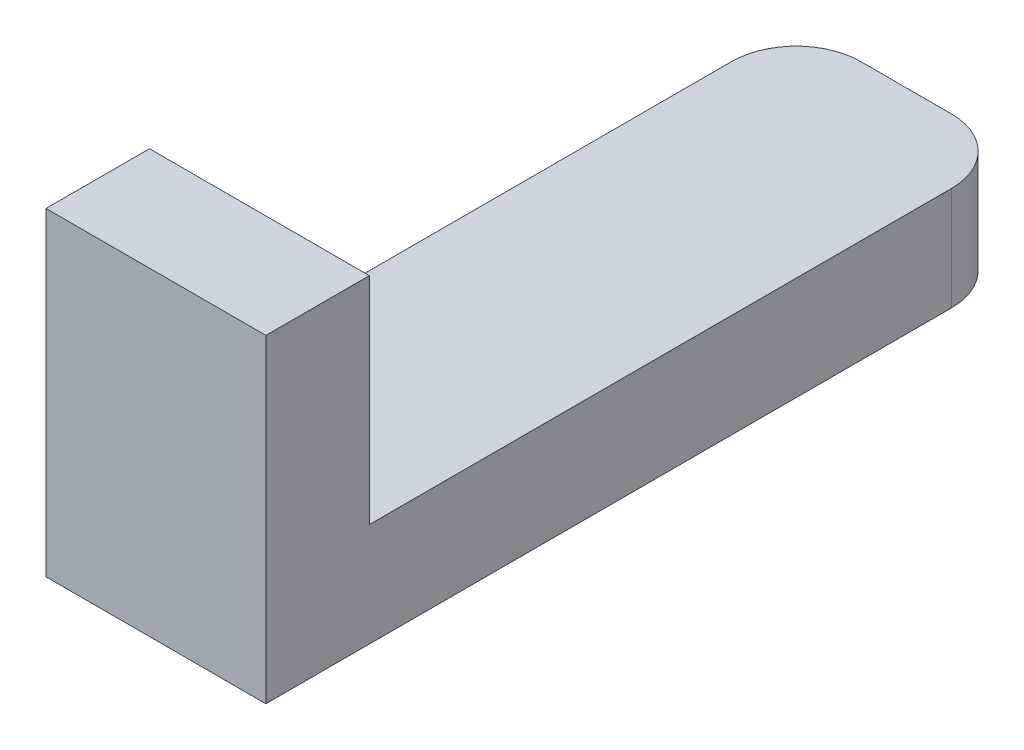
ISO-10303-21;
HEADER;
FILE_DESCRIPTION(('STEP AP214'),'2;1');
FILE_NAME('part.step','',(''),(''),'','','');
FILE_SCHEMA(('AUTOMOTIVE_DESIGN { 1 0 10303 214 1 1 1 1 }'));
ENDSEC;
DATA;
#1=APPLICATION_CONTEXT('core data for automotive mechanical design processes');
#2=APPLICATION_PROTOCOL_DEFINITION('international standard','automotive_design',2000,#1);
#3=PRODUCT_CONTEXT('',#1,'mechanical');
#4=PRODUCT('Part','Part','',(#3));
#5=PRODUCT_RELATED_PRODUCT_CATEGORY('part','',(#4));
#6=PRODUCT_DEFINITION_FORMATION('','',#4);
#7=PRODUCT_DEFINITION_CONTEXT('part definition',#1,'design');
#8=PRODUCT_DEFINITION('design','',#6,#7);
#9=PRODUCT_DEFINITION_SHAPE('','',#8);
#10=(LENGTH_UNIT() NAMED_UNIT(*) SI_UNIT(.MILLI.,.METRE.));
#11=(NAMED_UNIT(*) PLANE_ANGLE_UNIT() SI_UNIT($,.RADIAN.));
#12=(NAMED_UNIT(*) SI_UNIT($,.STERADIAN.) SOLID_ANGLE_UNIT());
#13=UNCERTAINTY_MEASURE_WITH_UNIT(LENGTH_MEASURE(1.E-05),#10,'distance_accuracy_value','');
#14=(GEOMETRIC_REPRESENTATION_CONTEXT(3) GLOBAL_UNCERTAINTY_ASSIGNED_CONTEXT((#13)) GLOBAL_UNIT_ASSIGNED_CONTEXT((#10,
#11,#12)) REPRESENTATION_CONTEXT('',''));
#15=CARTESIAN_POINT('',(0.,0.,0.));
#16=DIRECTION('',(0.,0.,1.));
#17=DIRECTION('',(1.,0.,0.));
#18=AXIS2_PLACEMENT_3D('',#15,#16,#17);
#19=CARTESIAN_POINT('',(6.477,9.398,22.098));
#20=DIRECTION('',(0.,0.,-1.));
#21=DIRECTION('',(-1.,0.,0.));
#22=AXIS2_PLACEMENT_3D('',#19,#20,#21);
#23=PLANE('',#22);
#24=DIRECTION('',(0.,-1.,0.));
#25=VECTOR('',#24,1.);
#26=CARTESIAN_POINT('',(0.,9.398,22.098));
#27=LINE('',#26,#25);
#28=CARTESIAN_POINT('',(0.,9.398,22.098));
#29=VERTEX_POINT('',#28);
#30=CARTESIAN_POINT('',(0.,0.,22.098));
#31=VERTEX_POINT('',#30);
#32=EDGE_CURVE('E128',#29,#31,#27,.T.);
#33=ORIENTED_EDGE('',*,*,#32,.T.);
#34=DIRECTION('',(-1.,0.,0.));
#35=VECTOR('',#34,1.);
#36=CARTESIAN_POINT('',(6.477,0.,22.098));
#37=LINE('',#36,#35);
#38=CARTESIAN_POINT('',(6.477,0.,22.098));
#39=VERTEX_POINT('',#38);
#40=EDGE_CURVE('E109',#39,#31,#37,.T.);
#41=ORIENTED_EDGE('',*,*,#40,.F.);
#42=DIRECTION('',(0.,-1.,0.));
#43=VECTOR('',#42,1.);
#44=CARTESIAN_POINT('',(6.477,9.398,22.098));
#45=LINE('',#44,#43);
#46=CARTESIAN_POINT('',(6.477,9.398,22.098));
#47=VERTEX_POINT('',#46);
#48=EDGE_CURVE('E115',#47,#39,#45,.T.);
#49=ORIENTED_EDGE('',*,*,#48,.F.);
#50=DIRECTION('',(-1.,0.,0.));
#51=VECTOR('',#50,1.);
#52=CARTESIAN_POINT('',(6.477,9.398,22.098));
#53=LINE('',#52,#51);
#54=EDGE_CURVE('E184',#47,#29,#53,.T.);
#55=ORIENTED_EDGE('',*,*,#54,.T.);
#56=EDGE_LOOP('',(#33,#41,#49,#55));
#57=FACE_BOUND('',#56,.T.);
#58=ADVANCED_FACE('F39',(#57),#23,.F.);
#59=CARTESIAN_POINT('',(6.477,0.,22.098));
#60=DIRECTION('',(0.,1.,0.));
#61=DIRECTION('',(0.,0.,1.));
#62=AXIS2_PLACEMENT_3D('',#59,#60,#61);
#63=PLANE('',#62);
#64=DIRECTION('',(0.,0.,-1.));
#65=VECTOR('',#64,1.);
#66=CARTESIAN_POINT('',(0.,0.,22.098));
#67=LINE('',#66,#65);
#68=CARTESIAN_POINT('',(0.,0.,1.905));
#69=VERTEX_POINT('',#68);
#70=EDGE_CURVE('E156',#31,#69,#67,.T.);
#71=ORIENTED_EDGE('',*,*,#70,.T.);
#72=CARTESIAN_POINT('',(1.905,0.,1.905));
#73=DIRECTION('',(0.,1.,0.));
#74=DIRECTION('',(0.,0.,1.));
#75=AXIS2_PLACEMENT_3D('',#72,#73,#74);
#76=CIRCLE('',#75,1.905);
#77=CARTESIAN_POINT('',(1.905,0.,0.));
#78=VERTEX_POINT('',#77);
#79=EDGE_CURVE('E48',#69,#78,#76,.F.);
#80=ORIENTED_EDGE('',*,*,#79,.T.);
#81=DIRECTION('',(-1.,0.,0.));
#82=VECTOR('',#81,1.);
#83=CARTESIAN_POINT('',(6.477,0.,0.));
#84=LINE('',#83,#82);
#85=CARTESIAN_POINT('',(4.572,0.,0.));
#86=VERTEX_POINT('',#85);
#87=EDGE_CURVE('E131',#86,#78,#84,.T.);
#88=ORIENTED_EDGE('',*,*,#87,.F.);
#89=CARTESIAN_POINT('',(4.572,0.,1.905));
#90=DIRECTION('',(0.,1.,0.));
#91=DIRECTION('',(0.,0.,1.));
#92=AXIS2_PLACEMENT_3D('',#89,#90,#91);
#93=CIRCLE('',#92,1.905);
#94=CARTESIAN_POINT('',(6.477,0.,1.905));
#95=VERTEX_POINT('',#94);
#96=EDGE_CURVE('E55',#86,#95,#93,.F.);
#97=ORIENTED_EDGE('',*,*,#96,.T.);
#98=DIRECTION('',(0.,0.,-1.));
#99=VECTOR('',#98,1.);
#100=CARTESIAN_POINT('',(6.477,0.,22.098));
#101=LINE('',#100,#99);
#102=EDGE_CURVE('E105',#39,#95,#101,.T.);
#103=ORIENTED_EDGE('',*,*,#102,.F.);
#104=ORIENTED_EDGE('',*,*,#40,.T.);
#105=EDGE_LOOP('',(#71,#80,#88,#97,#103,#104));
#106=FACE_BOUND('',#105,.T.);
#107=ADVANCED_FACE('F107',(#106),#63,.F.);
#108=CARTESIAN_POINT('',(6.477,0.,0.));
#109=DIRECTION('',(0.,0.,1.));
#110=DIRECTION('',(1.,0.,0.));
#111=AXIS2_PLACEMENT_3D('',#108,#109,#110);
#112=PLANE('',#111);
#113=ORIENTED_EDGE('',*,*,#87,.T.);
#114=DIRECTION('',(0.,1.,0.));
#115=VECTOR('',#114,1.);
#116=CARTESIAN_POINT('',(1.905,0.,0.));
#117=LINE('',#116,#115);
#118=CARTESIAN_POINT('',(1.905,3.048,0.));
#119=VERTEX_POINT('',#118);
#120=EDGE_CURVE('E135',#78,#119,#117,.T.);
#121=ORIENTED_EDGE('',*,*,#120,.T.);
#122=DIRECTION('',(-1.,0.,0.));
#123=VECTOR('',#122,1.);
#124=CARTESIAN_POINT('',(6.477,3.048,0.));
#125=LINE('',#124,#123);
#126=CARTESIAN_POINT('',(4.572,3.048,0.));
#127=VERTEX_POINT('',#126);
#128=EDGE_CURVE('E138',#127,#119,#125,.T.);
#129=ORIENTED_EDGE('',*,*,#128,.F.);
#130=DIRECTION('',(0.,1.,0.));
#131=VECTOR('',#130,1.);
#132=CARTESIAN_POINT('',(4.572,0.,0.));
#133=LINE('',#132,#131);
#134=EDGE_CURVE('E130',#127,#86,#133,.F.);
#135=ORIENTED_EDGE('',*,*,#134,.T.);
#136=EDGE_LOOP('',(#113,#121,#129,#135));
#137=FACE_BOUND('',#136,.T.);
#138=ADVANCED_FACE('F160',(#137),#112,.F.);
#139=CARTESIAN_POINT('',(6.477,3.048,0.));
#140=DIRECTION('',(0.,-1.,0.));
#141=DIRECTION('',(0.,0.,-1.));
#142=AXIS2_PLACEMENT_3D('',#139,#140,#141);
#143=PLANE('',#142);
#144=ORIENTED_EDGE('',*,*,#128,.T.);
#145=CARTESIAN_POINT('',(1.905,3.048,1.905));
#146=DIRECTION('',(0.,-1.,0.));
#147=DIRECTION('',(0.,0.,-1.));
#148=AXIS2_PLACEMENT_3D('',#145,#146,#147);
#149=CIRCLE('',#148,1.905);
#150=CARTESIAN_POINT('',(0.,3.048,1.905));
#151=VERTEX_POINT('',#150);
#152=EDGE_CURVE('E148',#119,#151,#149,.F.);
#153=ORIENTED_EDGE('',*,*,#152,.T.);
#154=DIRECTION('',(0.,0.,1.));
#155=VECTOR('',#154,1.);
#156=CARTESIAN_POINT('',(0.,3.048,0.));
#157=LINE('',#156,#155);
#158=CARTESIAN_POINT('',(0.,3.048,19.05));
#159=VERTEX_POINT('',#158);
#160=EDGE_CURVE('E168',#151,#159,#157,.T.);
#161=ORIENTED_EDGE('',*,*,#160,.T.);
#162=DIRECTION('',(-1.,0.,0.));
#163=VECTOR('',#162,1.);
#164=CARTESIAN_POINT('',(6.477,3.048,19.05));
#165=LINE('',#164,#163);
#166=CARTESIAN_POINT('',(6.477,3.048,19.05));
#167=VERTEX_POINT('',#166);
#168=EDGE_CURVE('E191',#167,#159,#165,.T.);
#169=ORIENTED_EDGE('',*,*,#168,.F.);
#170=DIRECTION('',(0.,0.,1.));
#171=VECTOR('',#170,1.);
#172=CARTESIAN_POINT('',(6.477,3.048,0.));
#173=LINE('',#172,#171);
#174=CARTESIAN_POINT('',(6.477,3.048,1.905));
#175=VERTEX_POINT('',#174);
#176=EDGE_CURVE('E114',#175,#167,#173,.T.);
#177=ORIENTED_EDGE('',*,*,#176,.F.);
#178=CARTESIAN_POINT('',(4.572,3.048,1.905));
#179=DIRECTION('',(0.,-1.,0.));
#180=DIRECTION('',(0.,0.,-1.));
#181=AXIS2_PLACEMENT_3D('',#178,#179,#180);
#182=CIRCLE('',#181,1.905);
#183=EDGE_CURVE('E145',#175,#127,#182,.F.);
#184=ORIENTED_EDGE('',*,*,#183,.T.);
#185=EDGE_LOOP('',(#144,#153,#161,#169,#177,#184));
#186=FACE_BOUND('',#185,.T.);
#187=ADVANCED_FACE('F166',(#186),#143,.F.);
#188=CARTESIAN_POINT('',(6.477,3.048,19.05));
#189=DIRECTION('',(0.,0.,1.));
#190=DIRECTION('',(1.,0.,0.));
#191=AXIS2_PLACEMENT_3D('',#188,#189,#190);
#192=PLANE('',#191);
#193=DIRECTION('',(0.,1.,0.));
#194=VECTOR('',#193,1.);
#195=CARTESIAN_POINT('',(0.,3.048,19.05));
#196=LINE('',#195,#194);
#197=CARTESIAN_POINT('',(0.,9.398,19.05));
#198=VERTEX_POINT('',#197);
#199=EDGE_CURVE('E173',#159,#198,#196,.T.);
#200=ORIENTED_EDGE('',*,*,#199,.T.);
#201=DIRECTION('',(-1.,0.,0.));
#202=VECTOR('',#201,1.);
#203=CARTESIAN_POINT('',(6.477,9.398,19.05));
#204=LINE('',#203,#202);
#205=CARTESIAN_POINT('',(6.477,9.398,19.05));
#206=VERTEX_POINT('',#205);
#207=EDGE_CURVE('E187',#206,#198,#204,.T.);
#208=ORIENTED_EDGE('',*,*,#207,.F.);
#209=DIRECTION('',(0.,1.,0.));
#210=VECTOR('',#209,1.);
#211=CARTESIAN_POINT('',(6.477,3.048,19.05));
#212=LINE('',#211,#210);
#213=EDGE_CURVE('E196',#167,#206,#212,.T.);
#214=ORIENTED_EDGE('',*,*,#213,.F.);
#215=ORIENTED_EDGE('',*,*,#168,.T.);
#216=EDGE_LOOP('',(#200,#208,#214,#215));
#217=FACE_BOUND('',#216,.T.);
#218=ADVANCED_FACE('F206',(#217),#192,.F.);
#219=CARTESIAN_POINT('',(6.477,9.398,19.05));
#220=DIRECTION('',(0.,-1.,0.));
#221=DIRECTION('',(0.,0.,-1.));
#222=AXIS2_PLACEMENT_3D('',#219,#220,#221);
#223=PLANE('',#222);
#224=DIRECTION('',(0.,0.,1.));
#225=VECTOR('',#224,1.);
#226=CARTESIAN_POINT('',(0.,9.398,19.05));
#227=LINE('',#226,#225);
#228=EDGE_CURVE('E125',#198,#29,#227,.T.);
#229=ORIENTED_EDGE('',*,*,#228,.T.);
#230=ORIENTED_EDGE('',*,*,#54,.F.);
#231=DIRECTION('',(0.,0.,1.));
#232=VECTOR('',#231,1.);
#233=CARTESIAN_POINT('',(6.477,9.398,19.05));
#234=LINE('',#233,#232);
#235=EDGE_CURVE('E120',#206,#47,#234,.T.);
#236=ORIENTED_EDGE('',*,*,#235,.F.);
#237=ORIENTED_EDGE('',*,*,#207,.T.);
#238=EDGE_LOOP('',(#229,#230,#236,#237));
#239=FACE_BOUND('',#238,.T.);
#240=ADVANCED_FACE('F208',(#239),#223,.F.);
#241=CARTESIAN_POINT('',(6.477,0.,0.));
#242=DIRECTION('',(1.,0.,0.));
#243=DIRECTION('',(0.,0.,-1.));
#244=AXIS2_PLACEMENT_3D('',#241,#242,#243);
#245=PLANE('',#244);
#246=ORIENTED_EDGE('',*,*,#102,.T.);
#247=DIRECTION('',(0.,1.,0.));
#248=VECTOR('',#247,1.);
#249=CARTESIAN_POINT('',(6.477,3.048,1.905));
#250=LINE('',#249,#248);
#251=EDGE_CURVE('E11',#95,#175,#250,.T.);
#252=ORIENTED_EDGE('',*,*,#251,.T.);
#253=ORIENTED_EDGE('',*,*,#176,.T.);
#254=ORIENTED_EDGE('',*,*,#213,.T.);
#255=ORIENTED_EDGE('',*,*,#235,.T.);
#256=ORIENTED_EDGE('',*,*,#48,.T.);
#257=EDGE_LOOP('',(#246,#252,#253,#254,#255,#256));
#258=FACE_BOUND('',#257,.T.);
#259=ADVANCED_FACE('F118',(#258),#245,.T.);
#260=CARTESIAN_POINT('',(0.,0.,0.));
#261=DIRECTION('',(1.,0.,0.));
#262=DIRECTION('',(0.,0.,-1.));
#263=AXIS2_PLACEMENT_3D('',#260,#261,#262);
#264=PLANE('',#263);
#265=ORIENTED_EDGE('',*,*,#160,.F.);
#266=DIRECTION('',(0.,1.,0.));
#267=VECTOR('',#266,1.);
#268=CARTESIAN_POINT('',(0.,0.,1.905));
#269=LINE('',#268,#267);
#270=EDGE_CURVE('E63',#151,#69,#269,.F.);
#271=ORIENTED_EDGE('',*,*,#270,.T.);
#272=ORIENTED_EDGE('',*,*,#70,.F.);
#273=ORIENTED_EDGE('',*,*,#32,.F.);
#274=ORIENTED_EDGE('',*,*,#228,.F.);
#275=ORIENTED_EDGE('',*,*,#199,.F.);
#276=EDGE_LOOP('',(#265,#271,#272,#273,#274,#275));
#277=FACE_BOUND('',#276,.T.);
#278=ADVANCED_FACE('F171',(#277),#264,.F.);
#279=CARTESIAN_POINT('',(1.905,0.,1.905));
#280=DIRECTION('',(0.,1.,0.));
#281=DIRECTION('',(0.,0.,1.));
#282=AXIS2_PLACEMENT_3D('',#279,#280,#281);
#283=CYLINDRICAL_SURFACE('',#282,1.905);
#284=ORIENTED_EDGE('',*,*,#79,.F.);
#285=ORIENTED_EDGE('',*,*,#270,.F.);
#286=ORIENTED_EDGE('',*,*,#152,.F.);
#287=ORIENTED_EDGE('',*,*,#120,.F.);
#288=EDGE_LOOP('',(#284,#285,#286,#287));
#289=FACE_BOUND('',#288,.T.);
#290=ADVANCED_FACE('F164',(#289),#283,.T.);
#291=CARTESIAN_POINT('',(4.572,0.,1.905));
#292=DIRECTION('',(0.,-1.,0.));
#293=DIRECTION('',(0.,0.,-1.));
#294=AXIS2_PLACEMENT_3D('',#291,#292,#293);
#295=CYLINDRICAL_SURFACE('',#294,1.905);
#296=ORIENTED_EDGE('',*,*,#96,.F.);
#297=ORIENTED_EDGE('',*,*,#134,.F.);
#298=ORIENTED_EDGE('',*,*,#183,.F.);
#299=ORIENTED_EDGE('',*,*,#251,.F.);
#300=EDGE_LOOP('',(#296,#297,#298,#299));
#301=FACE_BOUND('',#300,.T.);
#302=ADVANCED_FACE('F41',(#301),#295,.T.);
#303=CLOSED_SHELL('',(#58,#107,#138,#187,#218,#240,#259,#278,#290,#302));
#304=MANIFOLD_SOLID_BREP('B2',#303);
#305=ADVANCED_BREP_SHAPE_REPRESENTATION('',(#18,#304),#14);
#306=SHAPE_DEFINITION_REPRESENTATION(#9,#305);
ENDSEC;
END-ISO-10303-21;
